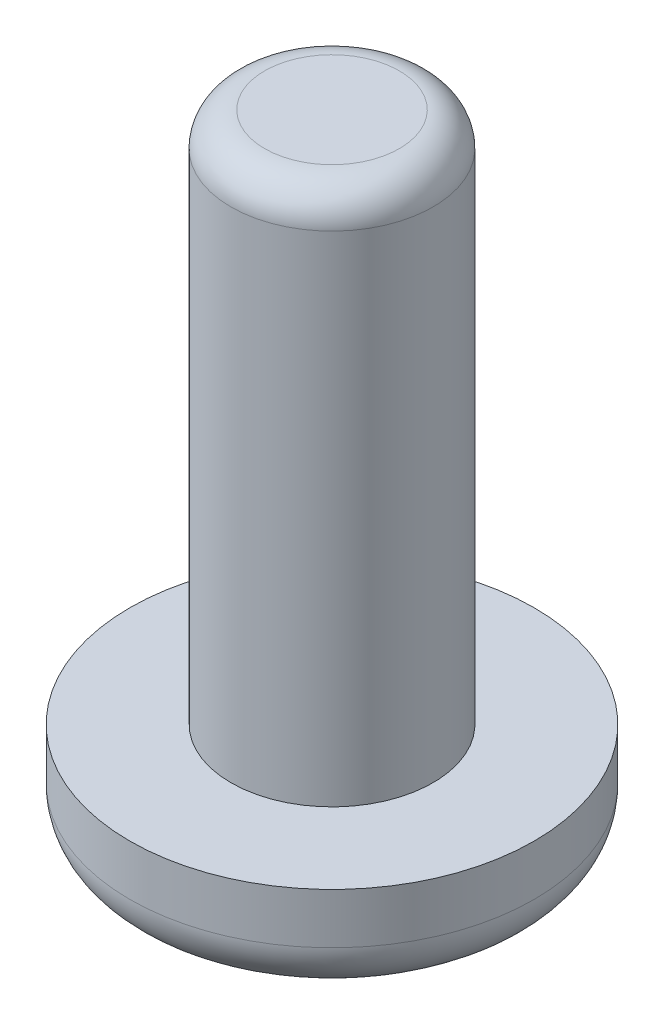
ISO-10303-21;
HEADER;
FILE_DESCRIPTION(('STEP AP214'),'2;1');
FILE_NAME('part.step','',(''),(''),'','','');
FILE_SCHEMA(('AUTOMOTIVE_DESIGN { 1 0 10303 214 1 1 1 1 }'));
ENDSEC;
DATA;
#1=APPLICATION_CONTEXT('core data for automotive mechanical design processes');
#2=APPLICATION_PROTOCOL_DEFINITION('international standard','automotive_design',2000,#1);
#3=PRODUCT_CONTEXT('',#1,'mechanical');
#4=PRODUCT('Part','Part','',(#3));
#5=PRODUCT_RELATED_PRODUCT_CATEGORY('part','',(#4));
#6=PRODUCT_DEFINITION_FORMATION('','',#4);
#7=PRODUCT_DEFINITION_CONTEXT('part definition',#1,'design');
#8=PRODUCT_DEFINITION('design','',#6,#7);
#9=PRODUCT_DEFINITION_SHAPE('','',#8);
#10=(LENGTH_UNIT() NAMED_UNIT(*) SI_UNIT(.MILLI.,.METRE.));
#11=(NAMED_UNIT(*) PLANE_ANGLE_UNIT() SI_UNIT($,.RADIAN.));
#12=(NAMED_UNIT(*) SI_UNIT($,.STERADIAN.) SOLID_ANGLE_UNIT());
#13=UNCERTAINTY_MEASURE_WITH_UNIT(LENGTH_MEASURE(1.E-05),#10,'distance_accuracy_value','');
#14=(GEOMETRIC_REPRESENTATION_CONTEXT(3) GLOBAL_UNCERTAINTY_ASSIGNED_CONTEXT((#13)) GLOBAL_UNIT_ASSIGNED_CONTEXT((#10,
#11,#12)) REPRESENTATION_CONTEXT('',''));
#15=CARTESIAN_POINT('',(0.,0.,0.));
#16=DIRECTION('',(0.,0.,1.));
#17=DIRECTION('',(1.,0.,0.));
#18=AXIS2_PLACEMENT_3D('',#15,#16,#17);
#19=CARTESIAN_POINT('',(0.,3.,0.));
#20=DIRECTION('',(0.,-1.,0.));
#21=DIRECTION('',(0.,0.,-1.));
#22=AXIS2_PLACEMENT_3D('',#19,#20,#21);
#23=CYLINDRICAL_SURFACE('',#22,6.);
#24=CARTESIAN_POINT('',(0.,1.5,0.));
#25=DIRECTION('',(0.,1.,0.));
#26=DIRECTION('',(0.,0.,1.));
#27=AXIS2_PLACEMENT_3D('',#24,#25,#26);
#28=CIRCLE('',#27,6.);
#29=CARTESIAN_POINT('',(0.,1.5,6.));
#30=VERTEX_POINT('',#29);
#31=EDGE_CURVE('E39',#30,#30,#28,.T.);
#32=ORIENTED_EDGE('',*,*,#31,.T.);
#33=EDGE_LOOP('',(#32));
#34=FACE_BOUND('',#33,.T.);
#35=CARTESIAN_POINT('',(0.,3.,0.));
#36=DIRECTION('',(0.,1.,0.));
#37=DIRECTION('',(0.,0.,1.));
#38=AXIS2_PLACEMENT_3D('',#35,#36,#37);
#39=CIRCLE('',#38,6.);
#40=CARTESIAN_POINT('',(0.,3.,6.));
#41=VERTEX_POINT('',#40);
#42=EDGE_CURVE('E53',#41,#41,#39,.T.);
#43=ORIENTED_EDGE('',*,*,#42,.F.);
#44=EDGE_LOOP('',(#43));
#45=FACE_BOUND('',#44,.T.);
#46=ADVANCED_FACE('F32',(#34,#45),#23,.T.);
#47=CARTESIAN_POINT('',(0.,3.,0.));
#48=DIRECTION('',(0.,1.,0.));
#49=DIRECTION('',(0.,0.,1.));
#50=AXIS2_PLACEMENT_3D('',#47,#48,#49);
#51=PLANE('',#50);
#52=CARTESIAN_POINT('',(0.,3.,0.));
#53=DIRECTION('',(0.,1.,0.));
#54=DIRECTION('',(0.,0.,1.));
#55=AXIS2_PLACEMENT_3D('',#52,#53,#54);
#56=CIRCLE('',#55,3.);
#57=CARTESIAN_POINT('',(0.,3.,3.));
#58=VERTEX_POINT('',#57);
#59=EDGE_CURVE('E52',#58,#58,#56,.T.);
#60=ORIENTED_EDGE('',*,*,#59,.F.);
#61=EDGE_LOOP('',(#60));
#62=FACE_BOUND('',#61,.T.);
#63=ORIENTED_EDGE('',*,*,#42,.T.);
#64=EDGE_LOOP('',(#63));
#65=FACE_BOUND('',#64,.T.);
#66=ADVANCED_FACE('F61',(#62,#65),#51,.T.);
#67=CARTESIAN_POINT('',(0.,0.,0.));
#68=DIRECTION('',(0.,1.,0.));
#69=DIRECTION('',(0.,0.,1.));
#70=AXIS2_PLACEMENT_3D('',#67,#68,#69);
#71=PLANE('',#70);
#72=CARTESIAN_POINT('',(0.,0.,0.));
#73=DIRECTION('',(0.,1.,0.));
#74=DIRECTION('',(0.,0.,1.));
#75=AXIS2_PLACEMENT_3D('',#72,#73,#74);
#76=CIRCLE('',#75,4.5);
#77=CARTESIAN_POINT('',(0.,0.,4.5));
#78=VERTEX_POINT('',#77);
#79=EDGE_CURVE('E10',#78,#78,#76,.F.);
#80=ORIENTED_EDGE('',*,*,#79,.T.);
#81=EDGE_LOOP('',(#80));
#82=FACE_BOUND('',#81,.T.);
#83=ADVANCED_FACE('F64',(#82),#71,.F.);
#84=CARTESIAN_POINT('',(0.,18.8,0.));
#85=DIRECTION('',(0.,-1.,0.));
#86=DIRECTION('',(0.,0.,-1.));
#87=AXIS2_PLACEMENT_3D('',#84,#85,#86);
#88=CYLINDRICAL_SURFACE('',#87,3.);
#89=CARTESIAN_POINT('',(0.,17.8,0.));
#90=DIRECTION('',(0.,1.,0.));
#91=DIRECTION('',(0.,0.,1.));
#92=AXIS2_PLACEMENT_3D('',#89,#90,#91);
#93=CIRCLE('',#92,3.);
#94=CARTESIAN_POINT('',(0.,17.8,3.));
#95=VERTEX_POINT('',#94);
#96=EDGE_CURVE('E43',#95,#95,#93,.F.);
#97=ORIENTED_EDGE('',*,*,#96,.T.);
#98=EDGE_LOOP('',(#97));
#99=FACE_BOUND('',#98,.T.);
#100=ORIENTED_EDGE('',*,*,#59,.T.);
#101=EDGE_LOOP('',(#100));
#102=FACE_BOUND('',#101,.T.);
#103=ADVANCED_FACE('F59',(#99,#102),#88,.T.);
#104=CARTESIAN_POINT('',(0.,18.8,0.));
#105=DIRECTION('',(0.,1.,0.));
#106=DIRECTION('',(0.,0.,1.));
#107=AXIS2_PLACEMENT_3D('',#104,#105,#106);
#108=PLANE('',#107);
#109=CARTESIAN_POINT('',(0.,18.8,0.));
#110=DIRECTION('',(0.,1.,0.));
#111=DIRECTION('',(0.,0.,1.));
#112=AXIS2_PLACEMENT_3D('',#109,#110,#111);
#113=CIRCLE('',#112,2.);
#114=CARTESIAN_POINT('',(0.,18.8,2.));
#115=VERTEX_POINT('',#114);
#116=EDGE_CURVE('E47',#115,#115,#113,.T.);
#117=ORIENTED_EDGE('',*,*,#116,.T.);
#118=EDGE_LOOP('',(#117));
#119=FACE_BOUND('',#118,.T.);
#120=ADVANCED_FACE('F75',(#119),#108,.T.);
#121=CARTESIAN_POINT('',(0.,17.8,0.));
#122=DIRECTION('',(0.,1.,0.));
#123=DIRECTION('',(0.,0.,1.));
#124=AXIS2_PLACEMENT_3D('',#121,#122,#123);
#125=TOROIDAL_SURFACE('',#124,2.,1.);
#126=ORIENTED_EDGE('',*,*,#96,.F.);
#127=EDGE_LOOP('',(#126));
#128=FACE_BOUND('',#127,.T.);
#129=ORIENTED_EDGE('',*,*,#116,.F.);
#130=EDGE_LOOP('',(#129));
#131=FACE_BOUND('',#130,.T.);
#132=ADVANCED_FACE('F73',(#128,#131),#125,.T.);
#133=CARTESIAN_POINT('',(0.,1.5,0.));
#134=DIRECTION('',(0.,1.,0.));
#135=DIRECTION('',(0.,0.,1.));
#136=AXIS2_PLACEMENT_3D('',#133,#134,#135);
#137=TOROIDAL_SURFACE('',#136,4.5,1.5);
#138=ORIENTED_EDGE('',*,*,#79,.F.);
#139=EDGE_LOOP('',(#138));
#140=FACE_BOUND('',#139,.T.);
#141=ORIENTED_EDGE('',*,*,#31,.F.);
#142=EDGE_LOOP('',(#141));
#143=FACE_BOUND('',#142,.T.);
#144=ADVANCED_FACE('F34',(#140,#143),#137,.T.);
#145=CLOSED_SHELL('',(#46,#66,#83,#103,#120,#132,#144));
#146=MANIFOLD_SOLID_BREP('B2',#145);
#147=ADVANCED_BREP_SHAPE_REPRESENTATION('',(#18,#146),#14);
#148=SHAPE_DEFINITION_REPRESENTATION(#9,#147);
ENDSEC;
END-ISO-10303-21;
